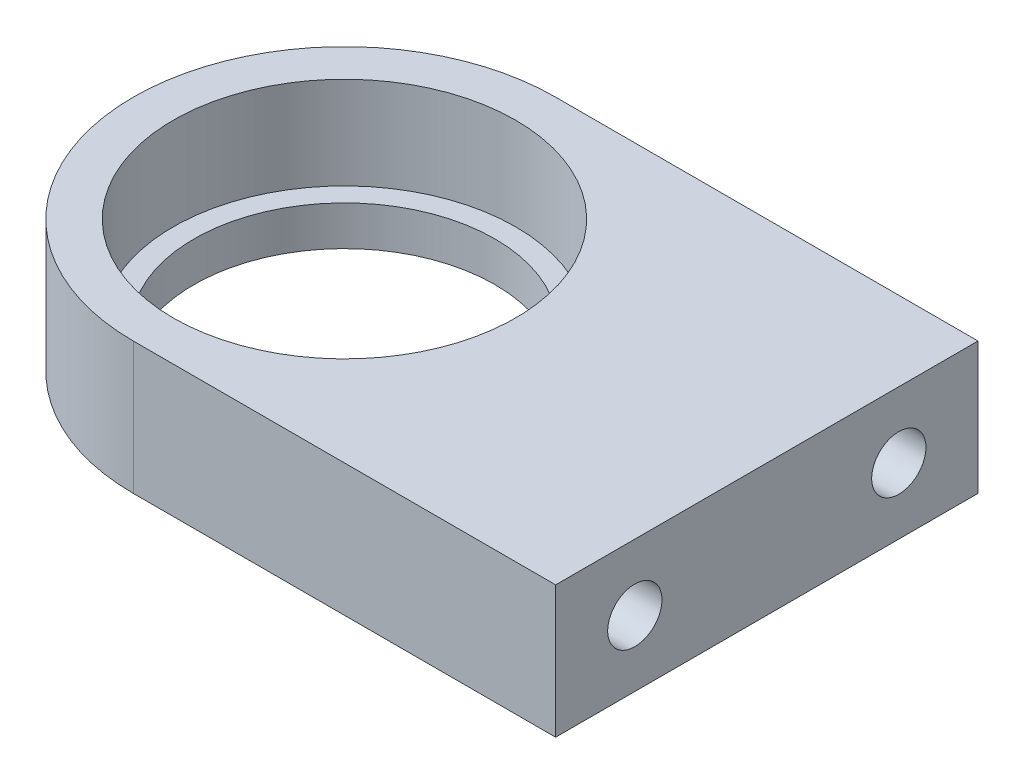
ISO-10303-21;
HEADER;
FILE_DESCRIPTION(('STEP AP214'),'2;1');
FILE_NAME('part.step','',(''),(''),'','','');
FILE_SCHEMA(('AUTOMOTIVE_DESIGN { 1 0 10303 214 1 1 1 1 }'));
ENDSEC;
DATA;
#1=APPLICATION_CONTEXT('core data for automotive mechanical design processes');
#2=APPLICATION_PROTOCOL_DEFINITION('international standard','automotive_design',2000,#1);
#3=PRODUCT_CONTEXT('',#1,'mechanical');
#4=PRODUCT('Part','Part','',(#3));
#5=PRODUCT_RELATED_PRODUCT_CATEGORY('part','',(#4));
#6=PRODUCT_DEFINITION_FORMATION('','',#4);
#7=PRODUCT_DEFINITION_CONTEXT('part definition',#1,'design');
#8=PRODUCT_DEFINITION('design','',#6,#7);
#9=PRODUCT_DEFINITION_SHAPE('','',#8);
#10=(LENGTH_UNIT() NAMED_UNIT(*) SI_UNIT(.MILLI.,.METRE.));
#11=(NAMED_UNIT(*) PLANE_ANGLE_UNIT() SI_UNIT($,.RADIAN.));
#12=(NAMED_UNIT(*) SI_UNIT($,.STERADIAN.) SOLID_ANGLE_UNIT());
#13=UNCERTAINTY_MEASURE_WITH_UNIT(LENGTH_MEASURE(1.E-05),#10,'distance_accuracy_value','');
#14=(GEOMETRIC_REPRESENTATION_CONTEXT(3) GLOBAL_UNCERTAINTY_ASSIGNED_CONTEXT((#13)) GLOBAL_UNIT_ASSIGNED_CONTEXT((#10,
#11,#12)) REPRESENTATION_CONTEXT('',''));
#15=CARTESIAN_POINT('',(0.,0.,0.));
#16=DIRECTION('',(0.,0.,1.));
#17=DIRECTION('',(1.,0.,0.));
#18=AXIS2_PLACEMENT_3D('',#15,#16,#17);
#19=CARTESIAN_POINT('',(50.8,7.9375,-25.4));
#20=DIRECTION('',(0.,0.,1.));
#21=DIRECTION('',(1.,0.,0.));
#22=AXIS2_PLACEMENT_3D('',#19,#20,#21);
#23=PLANE('',#22);
#24=DIRECTION('',(-1.,0.,0.));
#25=VECTOR('',#24,1.);
#26=CARTESIAN_POINT('',(50.8,-7.9375,-25.4));
#27=LINE('',#26,#25);
#28=CARTESIAN_POINT('',(50.8,-7.9375,-25.4));
#29=VERTEX_POINT('',#28);
#30=CARTESIAN_POINT('',(0.,-7.9375,-25.4));
#31=VERTEX_POINT('',#30);
#32=EDGE_CURVE('E99',#29,#31,#27,.T.);
#33=ORIENTED_EDGE('',*,*,#32,.T.);
#34=DIRECTION('',(0.,1.,0.));
#35=VECTOR('',#34,1.);
#36=CARTESIAN_POINT('',(0.,-7.9375,-25.4));
#37=LINE('',#36,#35);
#38=CARTESIAN_POINT('',(0.,7.9375,-25.4));
#39=VERTEX_POINT('',#38);
#40=EDGE_CURVE('E58',#31,#39,#37,.T.);
#41=ORIENTED_EDGE('',*,*,#40,.T.);
#42=DIRECTION('',(-1.,0.,0.));
#43=VECTOR('',#42,1.);
#44=CARTESIAN_POINT('',(50.8,7.9375,-25.4));
#45=LINE('',#44,#43);
#46=CARTESIAN_POINT('',(50.8,7.9375,-25.4));
#47=VERTEX_POINT('',#46);
#48=EDGE_CURVE('E94',#47,#39,#45,.T.);
#49=ORIENTED_EDGE('',*,*,#48,.F.);
#50=DIRECTION('',(0.,-1.,0.));
#51=VECTOR('',#50,1.);
#52=CARTESIAN_POINT('',(50.8,7.9375,-25.4));
#53=LINE('',#52,#51);
#54=EDGE_CURVE('E87',#47,#29,#53,.T.);
#55=ORIENTED_EDGE('',*,*,#54,.T.);
#56=EDGE_LOOP('',(#33,#41,#49,#55));
#57=FACE_BOUND('',#56,.T.);
#58=ADVANCED_FACE('F41',(#57),#23,.F.);
#59=CARTESIAN_POINT('',(-25.4,7.9375,25.4));
#60=DIRECTION('',(0.,0.,-1.));
#61=DIRECTION('',(-1.,0.,0.));
#62=AXIS2_PLACEMENT_3D('',#59,#60,#61);
#63=PLANE('',#62);
#64=DIRECTION('',(1.,0.,0.));
#65=VECTOR('',#64,1.);
#66=CARTESIAN_POINT('',(-25.4,7.9375,25.4));
#67=LINE('',#66,#65);
#68=CARTESIAN_POINT('',(0.,7.9375,25.4));
#69=VERTEX_POINT('',#68);
#70=CARTESIAN_POINT('',(50.8,7.9375,25.4));
#71=VERTEX_POINT('',#70);
#72=EDGE_CURVE('E119',#69,#71,#67,.T.);
#73=ORIENTED_EDGE('',*,*,#72,.F.);
#74=DIRECTION('',(0.,1.,0.));
#75=VECTOR('',#74,1.);
#76=CARTESIAN_POINT('',(0.,-7.9375,25.4));
#77=LINE('',#76,#75);
#78=CARTESIAN_POINT('',(0.,-7.9375,25.4));
#79=VERTEX_POINT('',#78);
#80=EDGE_CURVE('E126',#79,#69,#77,.T.);
#81=ORIENTED_EDGE('',*,*,#80,.F.);
#82=DIRECTION('',(1.,0.,0.));
#83=VECTOR('',#82,1.);
#84=CARTESIAN_POINT('',(-25.4,-7.9375,25.4));
#85=LINE('',#84,#83);
#86=CARTESIAN_POINT('',(50.8,-7.9375,25.4));
#87=VERTEX_POINT('',#86);
#88=EDGE_CURVE('E95',#79,#87,#85,.T.);
#89=ORIENTED_EDGE('',*,*,#88,.T.);
#90=DIRECTION('',(0.,-1.,0.));
#91=VECTOR('',#90,1.);
#92=CARTESIAN_POINT('',(50.8,7.9375,25.4));
#93=LINE('',#92,#91);
#94=EDGE_CURVE('E49',#71,#87,#93,.T.);
#95=ORIENTED_EDGE('',*,*,#94,.F.);
#96=EDGE_LOOP('',(#73,#81,#89,#95));
#97=FACE_BOUND('',#96,.T.);
#98=ADVANCED_FACE('F168',(#97),#63,.F.);
#99=CARTESIAN_POINT('',(50.8,7.9375,25.4));
#100=DIRECTION('',(-1.,0.,0.));
#101=DIRECTION('',(0.,0.,1.));
#102=AXIS2_PLACEMENT_3D('',#99,#100,#101);
#103=PLANE('',#102);
#104=CARTESIAN_POINT('',(50.8,0.,-15.875));
#105=DIRECTION('',(1.,0.,0.));
#106=DIRECTION('',(0.,0.,-1.));
#107=AXIS2_PLACEMENT_3D('',#104,#105,#106);
#108=CIRCLE('',#107,3.2639);
#109=CARTESIAN_POINT('',(50.8,0.,-19.1389));
#110=VERTEX_POINT('',#109);
#111=EDGE_CURVE('E122',#110,#110,#108,.T.);
#112=ORIENTED_EDGE('',*,*,#111,.F.);
#113=EDGE_LOOP('',(#112));
#114=FACE_BOUND('',#113,.T.);
#115=CARTESIAN_POINT('',(50.8,0.,15.875));
#116=DIRECTION('',(1.,0.,0.));
#117=DIRECTION('',(0.,0.,-1.));
#118=AXIS2_PLACEMENT_3D('',#115,#116,#117);
#119=CIRCLE('',#118,3.2639);
#120=CARTESIAN_POINT('',(50.8,0.,12.6111));
#121=VERTEX_POINT('',#120);
#122=EDGE_CURVE('E144',#121,#121,#119,.T.);
#123=ORIENTED_EDGE('',*,*,#122,.F.);
#124=EDGE_LOOP('',(#123));
#125=FACE_BOUND('',#124,.T.);
#126=DIRECTION('',(0.,0.,-1.));
#127=VECTOR('',#126,1.);
#128=CARTESIAN_POINT('',(50.8,-7.9375,25.4));
#129=LINE('',#128,#127);
#130=EDGE_CURVE('E84',#87,#29,#129,.T.);
#131=ORIENTED_EDGE('',*,*,#130,.T.);
#132=ORIENTED_EDGE('',*,*,#54,.F.);
#133=DIRECTION('',(0.,0.,-1.));
#134=VECTOR('',#133,1.);
#135=CARTESIAN_POINT('',(50.8,7.9375,25.4));
#136=LINE('',#135,#134);
#137=EDGE_CURVE('E68',#71,#47,#136,.T.);
#138=ORIENTED_EDGE('',*,*,#137,.F.);
#139=ORIENTED_EDGE('',*,*,#94,.T.);
#140=EDGE_LOOP('',(#131,#132,#138,#139));
#141=FACE_BOUND('',#140,.T.);
#142=ADVANCED_FACE('F86',(#114,#125,#141),#103,.F.);
#143=CARTESIAN_POINT('',(-25.4,7.9375,-25.4));
#144=DIRECTION('',(0.,1.,0.));
#145=DIRECTION('',(0.,0.,1.));
#146=AXIS2_PLACEMENT_3D('',#143,#144,#145);
#147=PLANE('',#146);
#148=CARTESIAN_POINT('',(0.,7.9375,0.));
#149=DIRECTION('',(0.,-1.,0.));
#150=DIRECTION('',(0.,0.,-1.));
#151=AXIS2_PLACEMENT_3D('',#148,#149,#150);
#152=CIRCLE('',#151,25.4);
#153=EDGE_CURVE('E153',#69,#39,#152,.T.);
#154=ORIENTED_EDGE('',*,*,#153,.F.);
#155=ORIENTED_EDGE('',*,*,#72,.T.);
#156=ORIENTED_EDGE('',*,*,#137,.T.);
#157=ORIENTED_EDGE('',*,*,#48,.T.);
#158=EDGE_LOOP('',(#154,#155,#156,#157));
#159=FACE_BOUND('',#158,.T.);
#160=CARTESIAN_POINT('',(0.,7.9375,0.));
#161=DIRECTION('',(0.,1.,0.));
#162=DIRECTION('',(0.,0.,1.));
#163=AXIS2_PLACEMENT_3D('',#160,#161,#162);
#164=CIRCLE('',#163,20.5994);
#165=CARTESIAN_POINT('',(0.,7.9375,20.5994));
#166=VERTEX_POINT('',#165);
#167=EDGE_CURVE('E112',#166,#166,#164,.T.);
#168=ORIENTED_EDGE('',*,*,#167,.F.);
#169=EDGE_LOOP('',(#168));
#170=FACE_BOUND('',#169,.T.);
#171=ADVANCED_FACE('F163',(#159,#170),#147,.T.);
#172=CARTESIAN_POINT('',(-25.4,-7.9375,-25.4));
#173=DIRECTION('',(0.,1.,0.));
#174=DIRECTION('',(0.,0.,1.));
#175=AXIS2_PLACEMENT_3D('',#172,#173,#174);
#176=PLANE('',#175);
#177=CARTESIAN_POINT('',(0.,-7.9375,0.));
#178=DIRECTION('',(0.,1.,0.));
#179=DIRECTION('',(0.,0.,1.));
#180=AXIS2_PLACEMENT_3D('',#177,#178,#179);
#181=CIRCLE('',#180,18.0975);
#182=CARTESIAN_POINT('',(0.,-7.9375,18.0975));
#183=VERTEX_POINT('',#182);
#184=EDGE_CURVE('E134',#183,#183,#181,.T.);
#185=ORIENTED_EDGE('',*,*,#184,.T.);
#186=EDGE_LOOP('',(#185));
#187=FACE_BOUND('',#186,.T.);
#188=ORIENTED_EDGE('',*,*,#88,.F.);
#189=CARTESIAN_POINT('',(0.,-7.9375,0.));
#190=DIRECTION('',(0.,1.,0.));
#191=DIRECTION('',(0.,0.,1.));
#192=AXIS2_PLACEMENT_3D('',#189,#190,#191);
#193=CIRCLE('',#192,25.4);
#194=EDGE_CURVE('E11',#79,#31,#193,.F.);
#195=ORIENTED_EDGE('',*,*,#194,.T.);
#196=ORIENTED_EDGE('',*,*,#32,.F.);
#197=ORIENTED_EDGE('',*,*,#130,.F.);
#198=EDGE_LOOP('',(#188,#195,#196,#197));
#199=FACE_BOUND('',#198,.T.);
#200=ADVANCED_FACE('F102',(#187,#199),#176,.F.);
#201=CARTESIAN_POINT('',(0.,-3.175,0.));
#202=DIRECTION('',(0.,1.,0.));
#203=DIRECTION('',(0.,0.,1.));
#204=AXIS2_PLACEMENT_3D('',#201,#202,#203);
#205=CYLINDRICAL_SURFACE('',#204,20.5994);
#206=CARTESIAN_POINT('',(0.,-3.175,0.));
#207=DIRECTION('',(0.,1.,0.));
#208=DIRECTION('',(0.,0.,1.));
#209=AXIS2_PLACEMENT_3D('',#206,#207,#208);
#210=CIRCLE('',#209,20.5994);
#211=CARTESIAN_POINT('',(0.,-3.175,20.5994));
#212=VERTEX_POINT('',#211);
#213=EDGE_CURVE('E104',#212,#212,#210,.T.);
#214=ORIENTED_EDGE('',*,*,#213,.F.);
#215=EDGE_LOOP('',(#214));
#216=FACE_BOUND('',#215,.T.);
#217=ORIENTED_EDGE('',*,*,#167,.T.);
#218=EDGE_LOOP('',(#217));
#219=FACE_BOUND('',#218,.T.);
#220=ADVANCED_FACE('F179',(#216,#219),#205,.F.);
#221=CARTESIAN_POINT('',(0.,-3.175,0.));
#222=DIRECTION('',(0.,1.,0.));
#223=DIRECTION('',(0.,0.,1.));
#224=AXIS2_PLACEMENT_3D('',#221,#222,#223);
#225=PLANE('',#224);
#226=CARTESIAN_POINT('',(0.,-3.175,0.));
#227=DIRECTION('',(0.,1.,0.));
#228=DIRECTION('',(0.,0.,1.));
#229=AXIS2_PLACEMENT_3D('',#226,#227,#228);
#230=CIRCLE('',#229,18.0975);
#231=CARTESIAN_POINT('',(0.,-3.175,18.0975));
#232=VERTEX_POINT('',#231);
#233=EDGE_CURVE('E139',#232,#232,#230,.T.);
#234=ORIENTED_EDGE('',*,*,#233,.F.);
#235=EDGE_LOOP('',(#234));
#236=FACE_BOUND('',#235,.T.);
#237=ORIENTED_EDGE('',*,*,#213,.T.);
#238=EDGE_LOOP('',(#237));
#239=FACE_BOUND('',#238,.T.);
#240=ADVANCED_FACE('F185',(#236,#239),#225,.T.);
#241=CARTESIAN_POINT('',(0.,-15.875,0.));
#242=DIRECTION('',(0.,1.,0.));
#243=DIRECTION('',(0.,0.,1.));
#244=AXIS2_PLACEMENT_3D('',#241,#242,#243);
#245=CYLINDRICAL_SURFACE('',#244,18.0975);
#246=ORIENTED_EDGE('',*,*,#233,.T.);
#247=EDGE_LOOP('',(#246));
#248=FACE_BOUND('',#247,.T.);
#249=ORIENTED_EDGE('',*,*,#184,.F.);
#250=EDGE_LOOP('',(#249));
#251=FACE_BOUND('',#250,.T.);
#252=ADVANCED_FACE('F189',(#248,#251),#245,.F.);
#253=CARTESIAN_POINT('',(31.75,0.,15.875));
#254=DIRECTION('',(1.,0.,0.));
#255=DIRECTION('',(0.,0.,-1.));
#256=AXIS2_PLACEMENT_3D('',#253,#254,#255);
#257=CYLINDRICAL_SURFACE('',#256,3.2639);
#258=CARTESIAN_POINT('',(31.75,0.,15.875));
#259=DIRECTION('',(1.,0.,0.));
#260=DIRECTION('',(0.,0.,-1.));
#261=AXIS2_PLACEMENT_3D('',#258,#259,#260);
#262=CIRCLE('',#261,3.2639);
#263=CARTESIAN_POINT('',(31.75,0.,12.6111));
#264=VERTEX_POINT('',#263);
#265=EDGE_CURVE('E143',#264,#264,#262,.T.);
#266=ORIENTED_EDGE('',*,*,#265,.F.);
#267=EDGE_LOOP('',(#266));
#268=FACE_BOUND('',#267,.T.);
#269=ORIENTED_EDGE('',*,*,#122,.T.);
#270=EDGE_LOOP('',(#269));
#271=FACE_BOUND('',#270,.T.);
#272=ADVANCED_FACE('F193',(#268,#271),#257,.F.);
#273=CARTESIAN_POINT('',(31.75,0.,15.875));
#274=DIRECTION('',(1.,0.,0.));
#275=DIRECTION('',(0.,0.,-1.));
#276=AXIS2_PLACEMENT_3D('',#273,#274,#275);
#277=PLANE('',#276);
#278=ORIENTED_EDGE('',*,*,#265,.T.);
#279=EDGE_LOOP('',(#278));
#280=FACE_BOUND('',#279,.T.);
#281=ADVANCED_FACE('F197',(#280),#277,.T.);
#282=CARTESIAN_POINT('',(31.75,0.,-15.875));
#283=DIRECTION('',(1.,0.,0.));
#284=DIRECTION('',(0.,0.,-1.));
#285=AXIS2_PLACEMENT_3D('',#282,#283,#284);
#286=CYLINDRICAL_SURFACE('',#285,3.2639);
#287=CARTESIAN_POINT('',(31.75,0.,-15.875));
#288=DIRECTION('',(1.,0.,0.));
#289=DIRECTION('',(0.,0.,-1.));
#290=AXIS2_PLACEMENT_3D('',#287,#288,#289);
#291=CIRCLE('',#290,3.2639);
#292=CARTESIAN_POINT('',(31.75,0.,-19.1389));
#293=VERTEX_POINT('',#292);
#294=EDGE_CURVE('E125',#293,#293,#291,.T.);
#295=ORIENTED_EDGE('',*,*,#294,.F.);
#296=EDGE_LOOP('',(#295));
#297=FACE_BOUND('',#296,.T.);
#298=ORIENTED_EDGE('',*,*,#111,.T.);
#299=EDGE_LOOP('',(#298));
#300=FACE_BOUND('',#299,.T.);
#301=ADVANCED_FACE('F201',(#297,#300),#286,.F.);
#302=CARTESIAN_POINT('',(31.75,0.,-15.875));
#303=DIRECTION('',(1.,0.,0.));
#304=DIRECTION('',(0.,0.,-1.));
#305=AXIS2_PLACEMENT_3D('',#302,#303,#304);
#306=PLANE('',#305);
#307=ORIENTED_EDGE('',*,*,#294,.T.);
#308=EDGE_LOOP('',(#307));
#309=FACE_BOUND('',#308,.T.);
#310=ADVANCED_FACE('F205',(#309),#306,.T.);
#311=CARTESIAN_POINT('',(0.,-7.9375,0.));
#312=DIRECTION('',(0.,1.,0.));
#313=DIRECTION('',(0.,0.,1.));
#314=AXIS2_PLACEMENT_3D('',#311,#312,#313);
#315=CYLINDRICAL_SURFACE('',#314,25.4);
#316=ORIENTED_EDGE('',*,*,#153,.T.);
#317=ORIENTED_EDGE('',*,*,#40,.F.);
#318=ORIENTED_EDGE('',*,*,#194,.F.);
#319=ORIENTED_EDGE('',*,*,#80,.T.);
#320=EDGE_LOOP('',(#316,#317,#318,#319));
#321=FACE_BOUND('',#320,.T.);
#322=ADVANCED_FACE('F158',(#321),#315,.T.);
#323=CLOSED_SHELL('',(#58,#98,#142,#171,#200,#220,#240,#252,#272,#281,#301,#310,#322));
#324=MANIFOLD_SOLID_BREP('B2',#323);
#325=ADVANCED_BREP_SHAPE_REPRESENTATION('',(#18,#324),#14);
#326=SHAPE_DEFINITION_REPRESENTATION(#9,#325);
ENDSEC;
END-ISO-10303-21;
